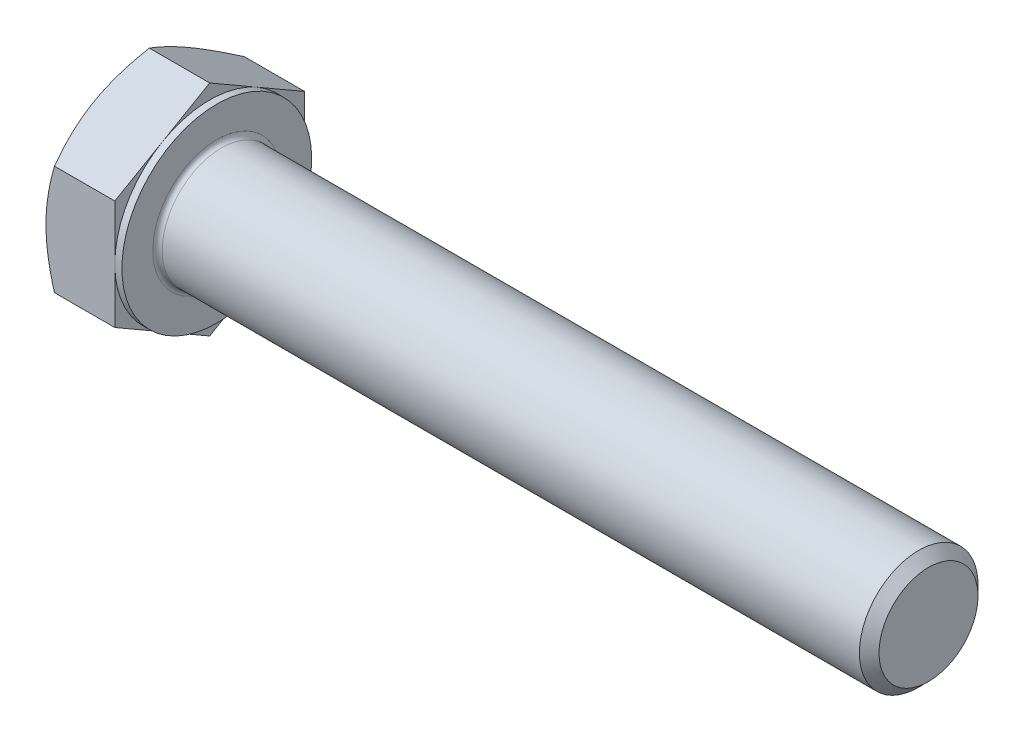
ISO-10303-21;
HEADER;
FILE_DESCRIPTION(('STEP AP214'),'2;1');
FILE_NAME('part.step','',(''),(''),'','','');
FILE_SCHEMA(('AUTOMOTIVE_DESIGN { 1 0 10303 214 1 1 1 1 }'));
ENDSEC;
DATA;
#1=APPLICATION_CONTEXT('core data for automotive mechanical design processes');
#2=APPLICATION_PROTOCOL_DEFINITION('international standard','automotive_design',2000,#1);
#3=PRODUCT_CONTEXT('',#1,'mechanical');
#4=PRODUCT('Part','Part','',(#3));
#5=PRODUCT_RELATED_PRODUCT_CATEGORY('part','',(#4));
#6=PRODUCT_DEFINITION_FORMATION('','',#4);
#7=PRODUCT_DEFINITION_CONTEXT('part definition',#1,'design');
#8=PRODUCT_DEFINITION('design','',#6,#7);
#9=PRODUCT_DEFINITION_SHAPE('','',#8);
#10=(LENGTH_UNIT() NAMED_UNIT(*) SI_UNIT(.MILLI.,.METRE.));
#11=(NAMED_UNIT(*) PLANE_ANGLE_UNIT() SI_UNIT($,.RADIAN.));
#12=(NAMED_UNIT(*) SI_UNIT($,.STERADIAN.) SOLID_ANGLE_UNIT());
#13=UNCERTAINTY_MEASURE_WITH_UNIT(LENGTH_MEASURE(1.E-05),#10,'distance_accuracy_value','');
#14=(GEOMETRIC_REPRESENTATION_CONTEXT(3) GLOBAL_UNCERTAINTY_ASSIGNED_CONTEXT((#13)) GLOBAL_UNIT_ASSIGNED_CONTEXT((#10,
#11,#12)) REPRESENTATION_CONTEXT('',''));
#15=CARTESIAN_POINT('',(0.,0.,0.));
#16=DIRECTION('',(0.,0.,1.));
#17=DIRECTION('',(1.,0.,0.));
#18=AXIS2_PLACEMENT_3D('',#15,#16,#17);
#19=CARTESIAN_POINT('',(6.4,9.23760430703402,0.));
#20=DIRECTION('',(1.,0.,0.));
#21=DIRECTION('',(0.,0.,-1.));
#22=AXIS2_PLACEMENT_3D('',#19,#20,#21);
#23=PLANE('',#22);
#24=CARTESIAN_POINT('',(6.4,0.,0.));
#25=DIRECTION('',(1.,0.,0.));
#26=DIRECTION('',(0.,0.,-1.));
#27=AXIS2_PLACEMENT_3D('',#24,#25,#26);
#28=CIRCLE('',#27,5.4);
#29=CARTESIAN_POINT('',(6.4,0.,-5.4));
#30=VERTEX_POINT('',#29);
#31=EDGE_CURVE('E44',#30,#30,#28,.F.);
#32=ORIENTED_EDGE('',*,*,#31,.T.);
#33=EDGE_LOOP('',(#32));
#34=FACE_BOUND('',#33,.T.);
#35=CARTESIAN_POINT('',(6.4,0.,0.));
#36=DIRECTION('',(1.,0.,0.));
#37=DIRECTION('',(0.,0.,-1.));
#38=AXIS2_PLACEMENT_3D('',#35,#36,#37);
#39=CIRCLE('',#38,8.);
#40=CARTESIAN_POINT('',(6.4,0.,-8.));
#41=VERTEX_POINT('',#40);
#42=EDGE_CURVE('E257',#41,#41,#39,.T.);
#43=ORIENTED_EDGE('',*,*,#42,.T.);
#44=EDGE_LOOP('',(#43));
#45=FACE_BOUND('',#44,.T.);
#46=ADVANCED_FACE('F35',(#34,#45),#23,.T.);
#47=CARTESIAN_POINT('',(0.,0.,0.));
#48=DIRECTION('',(-1.,0.,0.));
#49=DIRECTION('',(0.,0.,1.));
#50=AXIS2_PLACEMENT_3D('',#47,#48,#49);
#51=CYLINDRICAL_SURFACE('',#50,5.);
#52=CARTESIAN_POINT('',(6.8,0.,0.));
#53=DIRECTION('',(1.,0.,0.));
#54=DIRECTION('',(0.,0.,-1.));
#55=AXIS2_PLACEMENT_3D('',#52,#53,#54);
#56=CIRCLE('',#55,5.);
#57=CARTESIAN_POINT('',(6.8,0.,-5.));
#58=VERTEX_POINT('',#57);
#59=EDGE_CURVE('E11',#58,#58,#56,.T.);
#60=ORIENTED_EDGE('',*,*,#59,.T.);
#61=EDGE_LOOP('',(#60));
#62=FACE_BOUND('',#61,.T.);
#63=CARTESIAN_POINT('',(65.572,0.,0.));
#64=DIRECTION('',(-1.,0.,0.));
#65=DIRECTION('',(0.,0.,1.));
#66=AXIS2_PLACEMENT_3D('',#63,#64,#65);
#67=CIRCLE('',#66,5.);
#68=CARTESIAN_POINT('',(65.572,0.,5.));
#69=VERTEX_POINT('',#68);
#70=EDGE_CURVE('E303',#69,#69,#67,.T.);
#71=ORIENTED_EDGE('',*,*,#70,.T.);
#72=EDGE_LOOP('',(#71));
#73=FACE_BOUND('',#72,.T.);
#74=ADVANCED_FACE('F244',(#62,#73),#51,.T.);
#75=CARTESIAN_POINT('',(66.4,0.,0.));
#76=DIRECTION('',(-1.,0.,0.));
#77=DIRECTION('',(0.,0.,1.));
#78=AXIS2_PLACEMENT_3D('',#75,#76,#77);
#79=CONICAL_SURFACE('',#78,4.172,0.785398163397444);
#80=ORIENTED_EDGE('',*,*,#70,.F.);
#81=EDGE_LOOP('',(#80));
#82=FACE_BOUND('',#81,.T.);
#83=CARTESIAN_POINT('',(66.4,0.,0.));
#84=DIRECTION('',(-1.,0.,0.));
#85=DIRECTION('',(0.,0.,1.));
#86=AXIS2_PLACEMENT_3D('',#83,#84,#85);
#87=CIRCLE('',#86,4.172);
#88=CARTESIAN_POINT('',(66.4,0.,4.172));
#89=VERTEX_POINT('',#88);
#90=EDGE_CURVE('E305',#89,#89,#87,.T.);
#91=ORIENTED_EDGE('',*,*,#90,.T.);
#92=EDGE_LOOP('',(#91));
#93=FACE_BOUND('',#92,.T.);
#94=ADVANCED_FACE('F249',(#82,#93),#79,.T.);
#95=CARTESIAN_POINT('',(66.4,0.,0.));
#96=DIRECTION('',(-1.,0.,0.));
#97=DIRECTION('',(0.,0.,1.));
#98=AXIS2_PLACEMENT_3D('',#95,#96,#97);
#99=PLANE('',#98);
#100=ORIENTED_EDGE('',*,*,#90,.F.);
#101=EDGE_LOOP('',(#100));
#102=FACE_BOUND('',#101,.T.);
#103=ADVANCED_FACE('F352',(#102),#99,.F.);
#104=CARTESIAN_POINT('',(5.8,8.,0.));
#105=DIRECTION('',(1.,0.,0.));
#106=DIRECTION('',(0.,0.,-1.));
#107=AXIS2_PLACEMENT_3D('',#104,#105,#106);
#108=PLANE('',#107);
#109=DIRECTION('',(0.,0.500000000000001,0.866025403784438));
#110=VECTOR('',#109,1.);
#111=CARTESIAN_POINT('',(5.8,4.61880215351699,-8.));
#112=LINE('',#111,#110);
#113=CARTESIAN_POINT('',(5.8,4.61880215351699,-8.));
#114=VERTEX_POINT('',#113);
#115=CARTESIAN_POINT('',(5.8,6.9282032302755,-4.00000000000001));
#116=VERTEX_POINT('',#115);
#117=EDGE_CURVE('E168',#114,#116,#112,.T.);
#118=ORIENTED_EDGE('',*,*,#117,.T.);
#119=CARTESIAN_POINT('',(5.8,0.,0.));
#120=DIRECTION('',(-1.,0.,0.));
#121=DIRECTION('',(0.,0.,1.));
#122=AXIS2_PLACEMENT_3D('',#119,#120,#121);
#123=CIRCLE('',#122,8.);
#124=CARTESIAN_POINT('',(5.8,0.,-8.));
#125=VERTEX_POINT('',#124);
#126=EDGE_CURVE('E51',#116,#125,#123,.T.);
#127=ORIENTED_EDGE('',*,*,#126,.T.);
#128=DIRECTION('',(0.,1.,0.));
#129=VECTOR('',#128,1.);
#130=CARTESIAN_POINT('',(5.8,4.61880215351699,-8.));
#131=LINE('',#130,#129);
#132=EDGE_CURVE('E259',#125,#114,#131,.T.);
#133=ORIENTED_EDGE('',*,*,#132,.T.);
#134=EDGE_LOOP('',(#118,#127,#133));
#135=FACE_BOUND('',#134,.T.);
#136=ADVANCED_FACE('F282',(#135),#108,.T.);
#137=CARTESIAN_POINT('',(5.8,9.23760430703402,0.));
#138=VERTEX_POINT('',#137);
#139=EDGE_CURVE('E166',#116,#138,#112,.T.);
#140=ORIENTED_EDGE('',*,*,#139,.T.);
#141=DIRECTION('',(0.,-0.500000000000001,0.866025403784438));
#142=VECTOR('',#141,1.);
#143=CARTESIAN_POINT('',(5.8,9.23760430703402,0.));
#144=LINE('',#143,#142);
#145=CARTESIAN_POINT('',(5.8,6.92820323027551,4.00000000000001));
#146=VERTEX_POINT('',#145);
#147=EDGE_CURVE('E165',#138,#146,#144,.T.);
#148=ORIENTED_EDGE('',*,*,#147,.T.);
#149=EDGE_CURVE('E154',#146,#116,#123,.T.);
#150=ORIENTED_EDGE('',*,*,#149,.T.);
#151=EDGE_LOOP('',(#140,#148,#150));
#152=FACE_BOUND('',#151,.T.);
#153=ADVANCED_FACE('F289',(#152),#108,.T.);
#154=CARTESIAN_POINT('',(5.8,4.618802153517,8.));
#155=VERTEX_POINT('',#154);
#156=EDGE_CURVE('E133',#146,#155,#144,.T.);
#157=ORIENTED_EDGE('',*,*,#156,.T.);
#158=DIRECTION('',(0.,-1.,0.));
#159=VECTOR('',#158,1.);
#160=CARTESIAN_POINT('',(5.8,4.618802153517,8.));
#161=LINE('',#160,#159);
#162=CARTESIAN_POINT('',(5.8,0.,8.));
#163=VERTEX_POINT('',#162);
#164=EDGE_CURVE('E127',#155,#163,#161,.T.);
#165=ORIENTED_EDGE('',*,*,#164,.T.);
#166=EDGE_CURVE('E131',#163,#146,#123,.T.);
#167=ORIENTED_EDGE('',*,*,#166,.T.);
#168=EDGE_LOOP('',(#157,#165,#167));
#169=FACE_BOUND('',#168,.T.);
#170=ADVANCED_FACE('F129',(#169),#108,.T.);
#171=CARTESIAN_POINT('',(5.8,-4.61880215351701,8.));
#172=VERTEX_POINT('',#171);
#173=EDGE_CURVE('E137',#163,#172,#161,.T.);
#174=ORIENTED_EDGE('',*,*,#173,.T.);
#175=DIRECTION('',(0.,-0.500000000000002,-0.866025403784438));
#176=VECTOR('',#175,1.);
#177=CARTESIAN_POINT('',(5.8,-9.23760430703403,0.));
#178=LINE('',#177,#176);
#179=CARTESIAN_POINT('',(5.8,-6.9282032302755,4.00000000000001));
#180=VERTEX_POINT('',#179);
#181=EDGE_CURVE('E144',#172,#180,#178,.T.);
#182=ORIENTED_EDGE('',*,*,#181,.T.);
#183=EDGE_CURVE('E141',#180,#163,#123,.T.);
#184=ORIENTED_EDGE('',*,*,#183,.T.);
#185=EDGE_LOOP('',(#174,#182,#184));
#186=FACE_BOUND('',#185,.T.);
#187=ADVANCED_FACE('F142',(#186),#108,.T.);
#188=CARTESIAN_POINT('',(5.8,-9.23760430703403,0.));
#189=VERTEX_POINT('',#188);
#190=EDGE_CURVE('E160',#180,#189,#178,.T.);
#191=ORIENTED_EDGE('',*,*,#190,.T.);
#192=DIRECTION('',(0.,0.5,-0.866025403784438));
#193=VECTOR('',#192,1.);
#194=CARTESIAN_POINT('',(5.8,-4.61880215351702,-8.));
#195=LINE('',#194,#193);
#196=CARTESIAN_POINT('',(5.8,-6.92820323027551,-4.));
#197=VERTEX_POINT('',#196);
#198=EDGE_CURVE('E343',#189,#197,#195,.T.);
#199=ORIENTED_EDGE('',*,*,#198,.T.);
#200=EDGE_CURVE('E148',#197,#180,#123,.T.);
#201=ORIENTED_EDGE('',*,*,#200,.T.);
#202=EDGE_LOOP('',(#191,#199,#201));
#203=FACE_BOUND('',#202,.T.);
#204=ADVANCED_FACE('F344',(#203),#108,.T.);
#205=CARTESIAN_POINT('',(5.8,-4.61880215351702,-8.));
#206=VERTEX_POINT('',#205);
#207=EDGE_CURVE('E155',#197,#206,#195,.T.);
#208=ORIENTED_EDGE('',*,*,#207,.T.);
#209=EDGE_CURVE('E263',#206,#125,#131,.T.);
#210=ORIENTED_EDGE('',*,*,#209,.T.);
#211=EDGE_CURVE('E275',#125,#197,#123,.T.);
#212=ORIENTED_EDGE('',*,*,#211,.T.);
#213=EDGE_LOOP('',(#208,#210,#212));
#214=FACE_BOUND('',#213,.T.);
#215=ADVANCED_FACE('F274',(#214),#108,.T.);
#216=CARTESIAN_POINT('',(0.,0.,0.));
#217=DIRECTION('',(-1.,0.,0.));
#218=DIRECTION('',(0.,0.,1.));
#219=AXIS2_PLACEMENT_3D('',#216,#217,#218);
#220=CYLINDRICAL_SURFACE('',#219,8.);
#221=ORIENTED_EDGE('',*,*,#126,.F.);
#222=ORIENTED_EDGE('',*,*,#149,.F.);
#223=ORIENTED_EDGE('',*,*,#166,.F.);
#224=ORIENTED_EDGE('',*,*,#183,.F.);
#225=ORIENTED_EDGE('',*,*,#200,.F.);
#226=ORIENTED_EDGE('',*,*,#211,.F.);
#227=EDGE_LOOP('',(#221,#222,#223,#224,#225,#226));
#228=FACE_BOUND('',#227,.T.);
#229=ORIENTED_EDGE('',*,*,#42,.F.);
#230=EDGE_LOOP('',(#229));
#231=FACE_BOUND('',#230,.T.);
#232=ADVANCED_FACE('F151',(#228,#231),#220,.T.);
#233=CARTESIAN_POINT('',(0.,9.23760430703402,0.));
#234=DIRECTION('',(1.,0.,0.));
#235=DIRECTION('',(0.,0.,-1.));
#236=AXIS2_PLACEMENT_3D('',#233,#234,#235);
#237=PLANE('',#236);
#238=CARTESIAN_POINT('',(0.,0.,0.));
#239=DIRECTION('',(1.,0.,0.));
#240=DIRECTION('',(0.,0.,-1.));
#241=AXIS2_PLACEMENT_3D('',#238,#239,#240);
#242=CIRCLE('',#241,8.);
#243=CARTESIAN_POINT('',(0.,0.,-8.));
#244=VERTEX_POINT('',#243);
#245=CARTESIAN_POINT('',(0.,6.9282032302755,-4.00000000000001));
#246=VERTEX_POINT('',#245);
#247=EDGE_CURVE('E260',#244,#246,#242,.T.);
#248=ORIENTED_EDGE('',*,*,#247,.F.);
#249=CARTESIAN_POINT('',(0.,-6.92820323027551,-4.));
#250=VERTEX_POINT('',#249);
#251=EDGE_CURVE('E267',#250,#244,#242,.T.);
#252=ORIENTED_EDGE('',*,*,#251,.F.);
#253=CARTESIAN_POINT('',(0.,-6.9282032302755,4.00000000000001));
#254=VERTEX_POINT('',#253);
#255=EDGE_CURVE('E325',#254,#250,#242,.T.);
#256=ORIENTED_EDGE('',*,*,#255,.F.);
#257=CARTESIAN_POINT('',(0.,0.,8.));
#258=VERTEX_POINT('',#257);
#259=EDGE_CURVE('E321',#258,#254,#242,.T.);
#260=ORIENTED_EDGE('',*,*,#259,.F.);
#261=CARTESIAN_POINT('',(0.,0.,0.));
#262=DIRECTION('',(-1.,0.,0.));
#263=DIRECTION('',(0.,0.,1.));
#264=AXIS2_PLACEMENT_3D('',#261,#262,#263);
#265=CIRCLE('',#264,8.);
#266=CARTESIAN_POINT('',(0.,6.92820323027551,4.00000000000001));
#267=VERTEX_POINT('',#266);
#268=EDGE_CURVE('E169',#258,#267,#265,.T.);
#269=ORIENTED_EDGE('',*,*,#268,.T.);
#270=EDGE_CURVE('E265',#246,#267,#242,.T.);
#271=ORIENTED_EDGE('',*,*,#270,.F.);
#272=EDGE_LOOP('',(#248,#252,#256,#260,#269,#271));
#273=FACE_BOUND('',#272,.T.);
#274=ADVANCED_FACE('F322',(#273),#237,.F.);
#275=CARTESIAN_POINT('',(0.,0.,0.));
#276=DIRECTION('',(1.,0.,0.));
#277=DIRECTION('',(0.,0.,-1.));
#278=AXIS2_PLACEMENT_3D('',#275,#276,#277);
#279=CONICAL_SURFACE('',#278,8.,1.0471975511966);
#280=CARTESIAN_POINT('',(0.714597847732967,4.61868668346316,8.0002));
#281=CARTESIAN_POINT('',(0.655990714047292,4.72021302617289,7.8243512161201));
#282=CARTESIAN_POINT('',(0.600043401047285,4.82211789504564,7.64784680569387));
#283=CARTESIAN_POINT('',(0.494201005024662,5.02675523421805,7.29340453712154));
#284=CARTESIAN_POINT('',(0.444308534431063,5.12948804149869,7.11546609530729));
#285=CARTESIAN_POINT('',(0.304692797206863,5.43933133858026,6.57880176237736));
#286=CARTESIAN_POINT('',(0.225281170978366,5.64766491807817,6.21795741776428));
#287=CARTESIAN_POINT('',(0.132161646294487,5.95943209350317,5.67796082979595));
#288=CARTESIAN_POINT('',(0.105634581029123,6.06193429416807,5.50042181035672));
#289=CARTESIAN_POINT('',(0.0611531748588755,6.26740224104454,5.14454088703981));
#290=CARTESIAN_POINT('',(0.0431980765145798,6.37036794548792,4.96619905550676));
#291=CARTESIAN_POINT('',(0.0163156484918646,6.57647664551585,4.60920831517641));
#292=CARTESIAN_POINT('',(0.0073780735462325,6.67961930623067,4.4305599863905));
#293=CARTESIAN_POINT('',(-0.00127769603487081,6.88599991003618,4.07309829490262));
#294=CARTESIAN_POINT('',(-0.000996175497150669,6.98923785008464,3.89428493746994));
#295=CARTESIAN_POINT('',(0.00814502526877508,7.18224506616975,3.5599866329831));
#296=CARTESIAN_POINT('',(0.015889604367369,7.27202796205376,3.40447809566133));
#297=CARTESIAN_POINT('',(0.0382011348534271,7.45138347289924,3.09382523825949));
#298=CARTESIAN_POINT('',(0.0527685461381461,7.5409560732765,2.93868094344001));
#299=CARTESIAN_POINT('',(0.106360690527534,7.80932710333148,2.47384868410519));
#300=CARTESIAN_POINT('',(0.155268641669142,7.98765049311728,2.16498351281829));
#301=CARTESIAN_POINT('',(0.27753940323431,8.34618890253624,1.54397677123971));
#302=CARTESIAN_POINT('',(0.351420520375996,8.52635816315521,1.23191445788553));
#303=CARTESIAN_POINT('',(0.519100141254967,8.88400987687704,0.612443518305243));
#304=CARTESIAN_POINT('',(0.61285926085445,9.06149691008278,0.30502695910825));
#305=CARTESIAN_POINT('',(0.71459784773297,9.23771977708785,-0.000199999999999668));
#306=B_SPLINE_CURVE_WITH_KNOTS('',3,(#280,#281,#282,#283,#284,#285,#286,#287,#288,#289,#290,
#291,#292,#293,#294,#295,#296,#297,#298,#299,#300,#301,#302,#303,#304,#305),.UNSPECIFIED.,.F.,
.F.,(4,2,2,2,2,2,2,2,2,2,2,2,4),(0.,0.63397354372135,1.26821965714356,2.53934712434765,
3.15934343977049,3.77928496069783,4.39852133866765,5.01773858515595,5.55680239410248,
6.09590254421147,7.17487077411835,8.27776850154293,9.37850115249055),.UNSPECIFIED.);
#307=CARTESIAN_POINT('',(0.71453117981632,9.23760430703402,0.));
#308=VERTEX_POINT('',#307);
#309=EDGE_CURVE('E215',#267,#308,#306,.T.);
#310=ORIENTED_EDGE('',*,*,#309,.T.);
#311=CARTESIAN_POINT('',(0.71459784773297,9.23771977708785,0.0002));
#312=CARTESIAN_POINT('',(0.655990714047296,9.13619343437813,-0.175648783879896));
#313=CARTESIAN_POINT('',(0.600043401047289,9.03428856550538,-0.352153194306135));
#314=CARTESIAN_POINT('',(0.494201005024665,8.82965122633297,-0.70659546287846));
#315=CARTESIAN_POINT('',(0.444308534431065,8.72691841905233,-0.884533904692711));
#316=CARTESIAN_POINT('',(0.304692797206864,8.41707512197076,-1.42119823762264));
#317=CARTESIAN_POINT('',(0.225281170978367,8.20874154247284,-1.78204258223572));
#318=CARTESIAN_POINT('',(0.132161646294488,7.89697436704785,-2.32203917020405));
#319=CARTESIAN_POINT('',(0.105634581029123,7.79447216638294,-2.49957818964328));
#320=CARTESIAN_POINT('',(0.0611531748588745,7.58900421950647,-2.8554591129602));
#321=CARTESIAN_POINT('',(0.0431980765145785,7.4860385150631,-3.03380094449324));
#322=CARTESIAN_POINT('',(0.0163156484918633,7.27992981503517,-3.39079168482359));
#323=CARTESIAN_POINT('',(0.00737807354623154,7.17678715432034,-3.5694400136095));
#324=CARTESIAN_POINT('',(-0.00127769603487235,6.97040655051484,-3.92690170509738));
#325=CARTESIAN_POINT('',(-0.000996175497153107,6.86716861046638,-4.10571506253006));
#326=CARTESIAN_POINT('',(0.00814502526877204,6.67416139438126,-4.4400133670169));
#327=CARTESIAN_POINT('',(0.0158896043673661,6.58437849849726,-4.59552190433867));
#328=CARTESIAN_POINT('',(0.0382011348534242,6.40502298765178,-4.90617476174051));
#329=CARTESIAN_POINT('',(0.052768546138143,6.31545038727451,-5.06131905655999));
#330=CARTESIAN_POINT('',(0.106360690527531,6.04707935721953,-5.52615131589481));
#331=CARTESIAN_POINT('',(0.155268641669138,5.86875596743374,-5.83501648718171));
#332=CARTESIAN_POINT('',(0.277539403234306,5.51021755801477,-6.4560232287603));
#333=CARTESIAN_POINT('',(0.351420520375991,5.3300482973958,-6.76808554211447));
#334=CARTESIAN_POINT('',(0.519100141254961,4.97239658367397,-7.38755648169476));
#335=CARTESIAN_POINT('',(0.612859260854444,4.79490955046824,-7.69497304089175));
#336=CARTESIAN_POINT('',(0.714597847732965,4.61868668346316,-8.0002));
#337=B_SPLINE_CURVE_WITH_KNOTS('',3,(#311,#312,#313,#314,#315,#316,#317,#318,#319,#320,#321,
#322,#323,#324,#325,#326,#327,#328,#329,#330,#331,#332,#333,#334,#335,#336),.UNSPECIFIED.,.F.,
.F.,(4,2,2,2,2,2,2,2,2,2,2,2,4),(0.,0.63397354372135,1.26821965714356,2.53934712434766,
3.15934343977049,3.77928496069784,4.39852133866766,5.01773858515595,5.55680239410249,
6.09590254421148,7.17487077411835,8.27776850154293,9.37850115249055),.UNSPECIFIED.);
#338=EDGE_CURVE('E59',#308,#246,#337,.T.);
#339=ORIENTED_EDGE('',*,*,#338,.T.);
#340=ORIENTED_EDGE('',*,*,#270,.T.);
#341=EDGE_LOOP('',(#310,#339,#340));
#342=FACE_BOUND('',#341,.T.);
#343=ADVANCED_FACE('F319',(#342),#279,.T.);
#344=CARTESIAN_POINT('',(4.02490590955888,-12.6546855843617,7.99999999999999));
#345=CARTESIAN_POINT('',(3.8533848737599,-12.3031246800229,7.99999999999999));
#346=CARTESIAN_POINT('',(3.68343819387199,-11.9507829192251,7.99999999999999));
#347=CARTESIAN_POINT('',(3.34757427772114,-11.2441233293434,7.99999999999999));
#348=CARTESIAN_POINT('',(3.18165763115449,-10.889805220286,7.99999999999999));
#349=CARTESIAN_POINT('',(2.85395194343766,-10.1770689379398,7.99999999999999));
#350=CARTESIAN_POINT('',(2.6921882496399,-9.8186390717221,7.99999999999999));
#351=CARTESIAN_POINT('',(2.37495726740338,-9.09901412811099,7.99999999999999));
#352=CARTESIAN_POINT('',(2.21948969724233,-8.73781917530422,7.99999999999999));
#353=CARTESIAN_POINT('',(1.91124909611306,-7.99950051377995,7.99999999999999));
#354=CARTESIAN_POINT('',(1.75875676572666,-7.62225899058111,7.99999999999999));
#355=CARTESIAN_POINT('',(1.46472411298909,-6.86345576673942,7.99999999999999));
#356=CARTESIAN_POINT('',(1.32318498461756,-6.48189360029688,8.));
#357=CARTESIAN_POINT('',(1.05459432501407,-5.71447512364444,8.));
#358=CARTESIAN_POINT('',(0.927515476081558,-5.32862847439955,8.));
#359=CARTESIAN_POINT('',(0.691757211097742,-4.55141880373957,8.));
#360=CARTESIAN_POINT('',(0.583072254842115,-4.16005748194273,8.));
#361=CARTESIAN_POINT('',(0.38975037684422,-3.3737637827452,8.));
#362=CARTESIAN_POINT('',(0.304973724086276,-2.97886668674349,7.99999999999999));
#363=CARTESIAN_POINT('',(0.19927520023723,-2.38273452840882,8.));
#364=CARTESIAN_POINT('',(0.167618755709461,-2.1833797771194,8.));
#365=CARTESIAN_POINT('',(0.112075358694774,-1.78359737601686,8.));
#366=CARTESIAN_POINT('',(0.0881876500546175,-1.58316983255305,8.));
#367=CARTESIAN_POINT('',(0.0489706977401169,-1.18423542027826,8.));
#368=CARTESIAN_POINT('',(0.0335291730980847,-0.98573963745877,8.));
#369=CARTESIAN_POINT('',(0.0110629716488631,-0.588272086946685,8.));
#370=CARTESIAN_POINT('',(0.00403814825766994,-0.389300327604096,8.));
#371=CARTESIAN_POINT('',(-0.00142584062082165,0.00876221081483254,8.));
#372=CARTESIAN_POINT('',(0.00013495767647439,0.20785298938559,8.));
#373=CARTESIAN_POINT('',(0.0118014217876181,0.605786203078672,8.));
#374=CARTESIAN_POINT('',(0.0219074673810696,0.804628626769908,8.));
#375=CARTESIAN_POINT('',(0.0557165373437138,1.27520491378392,8.));
#376=CARTESIAN_POINT('',(0.083067269524206,1.54668291471763,8.));
#377=CARTESIAN_POINT('',(0.152259238389069,2.08777092307492,8.));
#378=CARTESIAN_POINT('',(0.194102243863654,2.35738069838156,8.));
#379=CARTESIAN_POINT('',(0.339163188799739,3.16301774665639,8.));
#380=CARTESIAN_POINT('',(0.461891294668971,3.69558688173418,8.));
#381=CARTESIAN_POINT('',(0.676586595213055,4.49226053267632,8.));
#382=CARTESIAN_POINT('',(0.754301850106125,4.76044512009595,8.));
#383=CARTESIAN_POINT('',(0.918275616254531,5.29421544036088,8.));
#384=CARTESIAN_POINT('',(1.00453419017724,5.55980115412708,8.));
#385=CARTESIAN_POINT('',(1.18417203245489,6.08844836893932,8.));
#386=CARTESIAN_POINT('',(1.27754931556251,6.35151055086868,8.));
#387=CARTESIAN_POINT('',(1.47027924561322,6.87542420819584,8.));
#388=CARTESIAN_POINT('',(1.56963178297476,7.13627572403553,8.));
#389=CARTESIAN_POINT('',(1.83061788216801,7.80218874880577,8.));
#390=CARTESIAN_POINT('',(1.99585030591403,8.20583800152905,8.));
#391=CARTESIAN_POINT('',(2.33560643435573,9.00922090340249,8.));
#392=CARTESIAN_POINT('',(2.5101309931742,9.40895418858895,8.));
#393=CARTESIAN_POINT('',(2.86641484762337,10.2053302393419,8.));
#394=CARTESIAN_POINT('',(3.04817649203488,10.6019719507727,8.));
#395=CARTESIAN_POINT('',(3.41731474780412,11.3926098653434,8.));
#396=CARTESIAN_POINT('',(3.60469117417195,11.7866061551194,8.));
#397=CARTESIAN_POINT('',(3.98417976786819,12.5730081264134,8.));
#398=CARTESIAN_POINT('',(4.17629837893023,12.9654106921397,8.));
#399=CARTESIAN_POINT('',(4.56413460673705,13.7484335593548,8.));
#400=CARTESIAN_POINT('',(4.75985224746017,14.1390538489476,8.));
#401=CARTESIAN_POINT('',(5.15417790496084,14.91873869301,8.));
#402=CARTESIAN_POINT('',(5.35278537052947,15.3078035265797,8.));
#403=CARTESIAN_POINT('',(5.75241277357112,16.0846929446673,8.));
#404=CARTESIAN_POINT('',(5.95343272118929,16.4725175239607,8.00000000000001));
#405=CARTESIAN_POINT('',(6.52023157707929,17.5591699504467,8.00000000000001));
#406=CARTESIAN_POINT('',(6.88826669162656,18.2568207923885,8.00000000000001));
#407=CARTESIAN_POINT('',(7.62911645716783,19.6496204420456,8.00000000000001));
#408=CARTESIAN_POINT('',(8.00193135552972,20.3447691178627,8.00000000000001));
#409=CARTESIAN_POINT('',(8.74998840178777,21.730949342628,8.00000000000001));
#410=CARTESIAN_POINT('',(9.12521929790285,22.4219869677796,8.00000000000001));
#411=CARTESIAN_POINT('',(9.69012625678299,23.4573861735835,8.00000000000001));
#412=CARTESIAN_POINT('',(9.87876537279042,23.8023143161837,8.00000000000001));
#413=CARTESIAN_POINT('',(10.2566598278907,24.4918321964472,8.00000000000001));
#414=CARTESIAN_POINT('',(10.4459151660087,24.8364219346447,8.00000000000001));
#415=CARTESIAN_POINT('',(10.635441440782,25.1808626322183,8.00000000000001));
#416=B_SPLINE_CURVE_WITH_KNOTS('',3,(#344,#345,#346,#347,#348,#349,#350,#351,#352,#353,#354,
#355,#356,#357,#358,#359,#360,#361,#362,#363,#364,#365,#366,#367,#368,#369,#370,#371,#372,#373,
#374,#375,#376,#377,#378,#379,#380,#381,#382,#383,#384,#385,#386,#387,#388,#389,#390,#391,#392,
#393,#394,#395,#396,#397,#398,#399,#400,#401,#402,#403,#404,#405,#406,#407,#408,#409,#410,#411,
#412,#413,#414,#415),.UNSPECIFIED.,.F.,.F.,(4,2,2,2,2,2,2,2,2,2,2,2,2,2,2,2,2,2,2,2,2,2,2,2,2,2,
2,2,2,2,2,2,2,2,2,4),(0.,1.17352534285519,2.34722138025917,3.52689945010167,4.70652467637677,
5.92708317141315,7.14777452944079,8.36612012171132,9.58409809506408,10.7948027119676,
11.4002329189197,12.0056041799731,12.6027191107726,13.199823642157,13.7969256548693,
14.3940542062034,15.2121538291978,16.0303533369241,17.6675489652002,18.5051258655031,
19.3427089100958,20.1800592201862,21.0173941785985,22.3257038346386,23.6341339573728,
24.9429922461244,26.2518074593073,27.5625113626671,28.8732240016859,30.1836898283921,
31.4941611678941,33.8604585893124,36.2268789719357,38.5858914350282,39.7653150976312,
40.9447368953005),.UNSPECIFIED.);
#417=CARTESIAN_POINT('',(0.714531179816316,4.618802153517,8.));
#418=VERTEX_POINT('',#417);
#419=EDGE_CURVE('E227',#258,#418,#416,.T.);
#420=ORIENTED_EDGE('',*,*,#419,.T.);
#421=EDGE_CURVE('E226',#418,#267,#306,.T.);
#422=ORIENTED_EDGE('',*,*,#421,.T.);
#423=ORIENTED_EDGE('',*,*,#268,.F.);
#424=EDGE_LOOP('',(#420,#422,#423));
#425=FACE_BOUND('',#424,.T.);
#426=ADVANCED_FACE('F316',(#425),#279,.T.);
#427=CARTESIAN_POINT('',(0.714531179816316,-4.61880215351701,8.));
#428=VERTEX_POINT('',#427);
#429=EDGE_CURVE('E307',#428,#258,#416,.T.);
#430=ORIENTED_EDGE('',*,*,#429,.T.);
#431=ORIENTED_EDGE('',*,*,#259,.T.);
#432=CARTESIAN_POINT('',(0.714597847732981,-9.23771977708787,-0.000199999999999317));
#433=CARTESIAN_POINT('',(0.655990714047306,-9.13619343437814,0.175648783879897));
#434=CARTESIAN_POINT('',(0.600043401047299,-9.0342885655054,0.352153194306136));
#435=CARTESIAN_POINT('',(0.494201005024674,-8.82965122633298,0.70659546287846));
#436=CARTESIAN_POINT('',(0.444308534431074,-8.72691841905234,0.884533904692713));
#437=CARTESIAN_POINT('',(0.304692797206873,-8.41707512197077,1.42119823762264));
#438=CARTESIAN_POINT('',(0.225281170978376,-8.20874154247286,1.78204258223573));
#439=CARTESIAN_POINT('',(0.132161646294496,-7.89697436704786,2.32203917020405));
#440=CARTESIAN_POINT('',(0.105634581029131,-7.79447216638296,2.49957818964329));
#441=CARTESIAN_POINT('',(0.0611531748588822,-7.58900421950648,2.8554591129602));
#442=CARTESIAN_POINT('',(0.0431980765145868,-7.48603851506311,3.03380094449324));
#443=CARTESIAN_POINT('',(0.0163156484918718,-7.27992981503518,3.3907916848236));
#444=CARTESIAN_POINT('',(0.00737807354623957,-7.17678715432036,3.5694400136095));
#445=CARTESIAN_POINT('',(-0.00127769603486461,-6.97040655051485,3.92690170509739));
#446=CARTESIAN_POINT('',(-0.000996175497145178,-6.86716861046639,4.10571506253007));
#447=CARTESIAN_POINT('',(0.00814502526878012,-6.67416139438127,4.44001336701691));
#448=CARTESIAN_POINT('',(0.0158896043673741,-6.58437849849727,4.59552190433867));
#449=CARTESIAN_POINT('',(0.0382011348534318,-6.40502298765179,4.90617476174051));
#450=CARTESIAN_POINT('',(0.05276854613815,-6.31545038727452,5.06131905656));
#451=CARTESIAN_POINT('',(0.106360690527537,-6.04707935721954,5.52615131589482));
#452=CARTESIAN_POINT('',(0.155268641669145,-5.86875596743375,5.83501648718172));
#453=CARTESIAN_POINT('',(0.277539403234312,-5.51021755801478,6.4560232287603));
#454=CARTESIAN_POINT('',(0.351420520375996,-5.33004829739581,6.76808554211448));
#455=CARTESIAN_POINT('',(0.519100141254965,-4.97239658367398,7.38755648169476));
#456=CARTESIAN_POINT('',(0.612859260854447,-4.79490955046825,7.69497304089175));
#457=CARTESIAN_POINT('',(0.714597847732967,-4.61868668346317,8.0002));
#458=B_SPLINE_CURVE_WITH_KNOTS('',3,(#432,#433,#434,#435,#436,#437,#438,#439,#440,#441,#442,
#443,#444,#445,#446,#447,#448,#449,#450,#451,#452,#453,#454,#455,#456,#457),.UNSPECIFIED.,.F.,
.F.,(4,2,2,2,2,2,2,2,2,2,2,2,4),(0.,0.633973543721351,1.26821965714356,2.53934712434766,
3.15934343977049,3.77928496069784,4.39852133866766,5.01773858515596,5.55680239410249,
6.09590254421148,7.17487077411835,8.27776850154293,9.37850115249055),.UNSPECIFIED.);
#459=EDGE_CURVE('E217',#254,#428,#458,.T.);
#460=ORIENTED_EDGE('',*,*,#459,.T.);
#461=EDGE_LOOP('',(#430,#431,#460));
#462=FACE_BOUND('',#461,.T.);
#463=ADVANCED_FACE('F187',(#462),#279,.T.);
#464=CARTESIAN_POINT('',(0.714531179816329,-9.23760430703403,0.));
#465=VERTEX_POINT('',#464);
#466=EDGE_CURVE('E210',#465,#254,#458,.T.);
#467=ORIENTED_EDGE('',*,*,#466,.T.);
#468=ORIENTED_EDGE('',*,*,#255,.T.);
#469=CARTESIAN_POINT('',(0.714597847732974,-4.61868668346318,-8.0002));
#470=CARTESIAN_POINT('',(0.655990714047299,-4.72021302617291,-7.82435121612011));
#471=CARTESIAN_POINT('',(0.600043401047292,-4.82211789504566,-7.64784680569387));
#472=CARTESIAN_POINT('',(0.494201005024669,-5.02675523421807,-7.29340453712154));
#473=CARTESIAN_POINT('',(0.44430853443107,-5.12948804149871,-7.11546609530729));
#474=CARTESIAN_POINT('',(0.304692797206871,-5.43933133858028,-6.57880176237736));
#475=CARTESIAN_POINT('',(0.225281170978374,-5.64766491807819,-6.21795741776428));
#476=CARTESIAN_POINT('',(0.132161646294495,-5.95943209350319,-5.67796082979595));
#477=CARTESIAN_POINT('',(0.105634581029131,-6.06193429416809,-5.50042181035672));
#478=CARTESIAN_POINT('',(0.0611531748588832,-6.26740224104457,-5.1445408870398));
#479=CARTESIAN_POINT('',(0.0431980765145875,-6.37036794548794,-4.96619905550676));
#480=CARTESIAN_POINT('',(0.0163156484918731,-6.57647664551587,-4.60920831517641));
#481=CARTESIAN_POINT('',(0.00737807354624189,-6.67961930623069,-4.4305599863905));
#482=CARTESIAN_POINT('',(-0.00127769603486067,-6.8859999100362,-4.07309829490262));
#483=CARTESIAN_POINT('',(-0.000996175497140609,-6.98923785008466,-3.89428493746993));
#484=CARTESIAN_POINT('',(0.00814502526878505,-7.18224506616977,-3.5599866329831));
#485=CARTESIAN_POINT('',(0.0158896043673789,-7.27202796205378,-3.40447809566133));
#486=CARTESIAN_POINT('',(0.0382011348534374,-7.45138347289926,-3.09382523825949));
#487=CARTESIAN_POINT('',(0.0527685461381567,-7.54095607327652,-2.93868094344));
#488=CARTESIAN_POINT('',(0.106360690527545,-7.8093271033315,-2.47384868410518));
#489=CARTESIAN_POINT('',(0.155268641669152,-7.9876504931173,-2.16498351281828));
#490=CARTESIAN_POINT('',(0.277539403234321,-8.34618890253626,-1.5439767712397));
#491=CARTESIAN_POINT('',(0.351420520376006,-8.52635816315523,-1.23191445788552));
#492=CARTESIAN_POINT('',(0.519100141254978,-8.88400987687706,-0.612443518305241));
#493=CARTESIAN_POINT('',(0.612859260854461,-9.06149691008279,-0.305026959108249));
#494=CARTESIAN_POINT('',(0.71459784773298,-9.23771977708787,0.000200000000000716));
#495=B_SPLINE_CURVE_WITH_KNOTS('',3,(#469,#470,#471,#472,#473,#474,#475,#476,#477,#478,#479,
#480,#481,#482,#483,#484,#485,#486,#487,#488,#489,#490,#491,#492,#493,#494),.UNSPECIFIED.,.F.,
.F.,(4,2,2,2,2,2,2,2,2,2,2,2,4),(0.,0.633973543721351,1.26821965714356,2.53934712434766,
3.15934343977049,3.77928496069784,4.39852133866766,5.01773858515595,5.55680239410249,
6.09590254421148,7.17487077411835,8.27776850154293,9.37850115249055),.UNSPECIFIED.);
#496=EDGE_CURVE('E216',#250,#465,#495,.T.);
#497=ORIENTED_EDGE('',*,*,#496,.T.);
#498=EDGE_LOOP('',(#467,#468,#497));
#499=FACE_BOUND('',#498,.T.);
#500=ADVANCED_FACE('F339',(#499),#279,.T.);
#501=CARTESIAN_POINT('',(0.714531179816313,4.61880215351699,-8.));
#502=VERTEX_POINT('',#501);
#503=EDGE_CURVE('E218',#246,#502,#337,.T.);
#504=ORIENTED_EDGE('',*,*,#503,.T.);
#505=CARTESIAN_POINT('',(4.02490591677327,-12.654685599145,-8.));
#506=CARTESIAN_POINT('',(3.8533848806743,-12.3031246943085,-8.));
#507=CARTESIAN_POINT('',(3.68343820048657,-11.9507829330126,-8.));
#508=CARTESIAN_POINT('',(3.34757428373752,-11.2441233421334,-8.));
#509=CARTESIAN_POINT('',(3.18165763687249,-10.8898052325765,-8.));
#510=CARTESIAN_POINT('',(2.85395194855878,-10.177068949224,-8.));
#511=CARTESIAN_POINT('',(2.69218825446257,-9.81863908249932,-8.));
#512=CARTESIAN_POINT('',(2.37495727163403,-9.09901413787102,-8.));
#513=CARTESIAN_POINT('',(2.21948970117939,-8.73781918455397,-8.));
#514=CARTESIAN_POINT('',(1.91124909945299,-7.99950052196693,-8.));
#515=CARTESIAN_POINT('',(1.75875676876377,-7.62225899821523,-8.));
#516=CARTESIAN_POINT('',(1.46472411543646,-6.86345577325908,-8.));
#517=CARTESIAN_POINT('',(1.32318498677801,-6.48189360625494,-8.));
#518=CARTESIAN_POINT('',(1.0545943266276,-5.71447512846895,-8.));
#519=CARTESIAN_POINT('',(0.92751547743501,-5.32862847865214,-8.));
#520=CARTESIAN_POINT('',(0.691757211972647,-4.55141880683299,-8.));
#521=CARTESIAN_POINT('',(0.583072255498522,-4.1600574844489,-8.));
#522=CARTESIAN_POINT('',(0.389750377059009,-3.37376378378106,-8.));
#523=CARTESIAN_POINT('',(0.30497372409415,-2.97886668689223,-8.));
#524=CARTESIAN_POINT('',(0.19927520003407,-2.38273452721078,-8.));
#525=CARTESIAN_POINT('',(0.167618755452533,-2.1833797754699,-8.));
#526=CARTESIAN_POINT('',(0.112075358367339,-1.78359737346044,-8.));
#527=CARTESIAN_POINT('',(0.0881876497104365,-1.58316982954116,-8.));
#528=CARTESIAN_POINT('',(0.0489706974028754,-1.18423541636503,-8.));
#529=CARTESIAN_POINT('',(0.0335291727837703,-0.985739633099708,-8.));
#530=CARTESIAN_POINT('',(0.0110629714200289,-0.588272081696592,-8.));
#531=CARTESIAN_POINT('',(0.00403814809138827,-0.389300321908802,-8.));
#532=CARTESIAN_POINT('',(-0.0014258406230809,0.00876221739737291,-8.));
#533=CARTESIAN_POINT('',(0.00013495777569058,0.207852996410176,-8.));
#534=CARTESIAN_POINT('',(0.011801422126109,0.605786210981713,-8.));
#535=CARTESIAN_POINT('',(0.0219074678573634,0.804628635109359,-8.));
#536=CARTESIAN_POINT('',(0.055716538158749,1.27520492278815,-8.));
#537=CARTESIAN_POINT('',(0.083067270533562,1.54668292394838,-8.));
#538=CARTESIAN_POINT('',(0.152259239797329,2.08777093274817,-8.));
#539=CARTESIAN_POINT('',(0.194102245476499,2.35738070827079,-8.));
#540=CARTESIAN_POINT('',(0.339163191030428,3.16301775718138,-8.));
#541=CARTESIAN_POINT('',(0.461891297316743,3.69558689266571,-8.));
#542=CARTESIAN_POINT('',(0.676586598475547,4.4922605442156,-8.));
#543=CARTESIAN_POINT('',(0.75430185357481,4.7604451318422,-8.));
#544=CARTESIAN_POINT('',(0.918275620129026,5.29421545251861,-8.));
#545=CARTESIAN_POINT('',(1.00453419425135,5.55980116648932,-8.));
#546=CARTESIAN_POINT('',(1.1841720369208,6.08844838170899,-8.));
#547=CARTESIAN_POINT('',(1.27754932022059,6.35151056384126,-8.));
#548=CARTESIAN_POINT('',(1.47027925064867,6.87542422157427,-8.));
#549=CARTESIAN_POINT('',(1.56963178819541,7.13627573761688,-8.));
#550=CARTESIAN_POINT('',(1.83061788769923,7.80218876251031,-8.));
#551=CARTESIAN_POINT('',(1.99585031155407,8.2058380151589,-8.));
#552=CARTESIAN_POINT('',(2.33560644018457,9.00922091689224,-8.));
#553=CARTESIAN_POINT('',(2.51013099908301,9.40895420201328,-8.));
#554=CARTESIAN_POINT('',(2.86641485367069,10.2053302526422,-8.));
#555=CARTESIAN_POINT('',(3.0481764981407,10.6019719640146,-8.));
#556=CARTESIAN_POINT('',(3.41731475401142,11.3926098784746,-8.));
#557=CARTESIAN_POINT('',(3.60469118042221,11.7866061681984,-8.));
#558=CARTESIAN_POINT('',(3.98417977419135,12.5730081393898,-8.));
#559=CARTESIAN_POINT('',(4.17629838528327,12.9654107050659,-8.));
#560=CARTESIAN_POINT('',(4.56413461314096,13.7484335721844,-8.));
#561=CARTESIAN_POINT('',(4.75985225388507,14.1390538617309,-8.));
#562=CARTESIAN_POINT('',(5.15417791142115,14.9187387057042,-8.));
#563=CARTESIAN_POINT('',(5.35278537700419,15.3078035392312,-8.));
#564=CARTESIAN_POINT('',(5.75241278006939,16.0846929572359,-8.));
#565=CARTESIAN_POINT('',(5.95343272769668,16.4725175364891,-8.));
#566=CARTESIAN_POINT('',(6.52023158363776,17.559169962925,-8.));
#567=CARTESIAN_POINT('',(6.88826669822287,18.2568208048589,-8.));
#568=CARTESIAN_POINT('',(7.62911646383152,19.6496204545043,-8.));
#569=CARTESIAN_POINT('',(8.00193136222293,20.3447691303174,-8.));
#570=CARTESIAN_POINT('',(8.74998840854042,21.7309493550892,-8.));
#571=CARTESIAN_POINT('',(9.12521930468549,22.4219869802513,-8.));
#572=CARTESIAN_POINT('',(9.69012626360773,23.4573861860725,-8.));
#573=CARTESIAN_POINT('',(9.87876537962874,23.8023143286788,-8.));
#574=CARTESIAN_POINT('',(10.2566598347553,24.491832208955,-8.));
#575=CARTESIAN_POINT('',(10.4459151728861,24.8364219471591,-8.));
#576=CARTESIAN_POINT('',(10.6354414476717,25.1808626447394,-8.));
#577=B_SPLINE_CURVE_WITH_KNOTS('',3,(#505,#506,#507,#508,#509,#510,#511,#512,#513,#514,#515,
#516,#517,#518,#519,#520,#521,#522,#523,#524,#525,#526,#527,#528,#529,#530,#531,#532,#533,#534,
#535,#536,#537,#538,#539,#540,#541,#542,#543,#544,#545,#546,#547,#548,#549,#550,#551,#552,#553,
#554,#555,#556,#557,#558,#559,#560,#561,#562,#563,#564,#565,#566,#567,#568,#569,#570,#571,#572,
#573,#574,#575,#576),.UNSPECIFIED.,.F.,.F.,(4,2,2,2,2,2,2,2,2,2,2,2,2,2,2,2,2,2,2,2,2,2,2,2,2,2,
2,2,2,2,2,2,2,2,2,4),(0.,1.17352534459167,2.34722138373236,3.52689945532928,4.70652468335868,
5.92708318027306,7.14777454017932,8.36612013432257,9.5840981095466,10.7948027291759,
11.40023293749,12.0056041999049,12.6027191320313,13.1998236647426,13.7969256787822,
14.3940542314437,15.2121538551722,16.0303533636327,17.6675489933806,18.5051258944524,
19.3427089398139,20.180059250671,21.0173942098502,22.3257038658076,23.6341339884585,
24.9429922771239,26.2518074902209,27.5625113934848,28.8732240324076,30.1836898590194,
31.4941611984269,33.8604586198774,36.2268790025322,38.5858914656951,39.7653151283338,
40.9447369260388),.UNSPECIFIED.);
#578=EDGE_CURVE('E180',#502,#244,#577,.F.);
#579=ORIENTED_EDGE('',*,*,#578,.T.);
#580=ORIENTED_EDGE('',*,*,#247,.T.);
#581=EDGE_LOOP('',(#504,#579,#580));
#582=FACE_BOUND('',#581,.T.);
#583=ADVANCED_FACE('F336',(#582),#279,.T.);
#584=CARTESIAN_POINT('',(0.714531179816158,-4.61880215351727,-8.));
#585=VERTEX_POINT('',#584);
#586=EDGE_CURVE('E181',#585,#250,#495,.T.);
#587=ORIENTED_EDGE('',*,*,#586,.T.);
#588=ORIENTED_EDGE('',*,*,#251,.T.);
#589=EDGE_CURVE('E172',#244,#585,#577,.F.);
#590=ORIENTED_EDGE('',*,*,#589,.T.);
#591=EDGE_LOOP('',(#587,#588,#590));
#592=FACE_BOUND('',#591,.T.);
#593=ADVANCED_FACE('F196',(#592),#279,.T.);
#594=CARTESIAN_POINT('',(6.4,4.61880215351699,-8.));
#595=DIRECTION('',(0.,0.,1.));
#596=DIRECTION('',(0.,-1.,0.));
#597=AXIS2_PLACEMENT_3D('',#594,#595,#596);
#598=PLANE('',#597);
#599=ORIENTED_EDGE('',*,*,#209,.F.);
#600=DIRECTION('',(-1.,0.,0.));
#601=VECTOR('',#600,1.);
#602=CARTESIAN_POINT('',(6.4,-4.61880215351702,-8.));
#603=LINE('',#602,#601);
#604=EDGE_CURVE('E300',#206,#585,#603,.T.);
#605=ORIENTED_EDGE('',*,*,#604,.T.);
#606=ORIENTED_EDGE('',*,*,#589,.F.);
#607=ORIENTED_EDGE('',*,*,#578,.F.);
#608=DIRECTION('',(-1.,0.,0.));
#609=VECTOR('',#608,1.);
#610=CARTESIAN_POINT('',(6.4,4.61880215351699,-8.));
#611=LINE('',#610,#609);
#612=EDGE_CURVE('E280',#114,#502,#611,.T.);
#613=ORIENTED_EDGE('',*,*,#612,.F.);
#614=ORIENTED_EDGE('',*,*,#132,.F.);
#615=EDGE_LOOP('',(#599,#605,#606,#607,#613,#614));
#616=FACE_BOUND('',#615,.T.);
#617=ADVANCED_FACE('F191',(#616),#598,.F.);
#618=CARTESIAN_POINT('',(6.4,-4.61880215351702,-8.));
#619=DIRECTION('',(0.,0.866025403784438,0.5));
#620=DIRECTION('',(0.,-0.5,0.866025403784438));
#621=AXIS2_PLACEMENT_3D('',#618,#619,#620);
#622=PLANE('',#621);
#623=ORIENTED_EDGE('',*,*,#198,.F.);
#624=DIRECTION('',(-1.,0.,0.));
#625=VECTOR('',#624,1.);
#626=CARTESIAN_POINT('',(6.4,-9.23760430703403,0.));
#627=LINE('',#626,#625);
#628=EDGE_CURVE('E296',#189,#465,#627,.T.);
#629=ORIENTED_EDGE('',*,*,#628,.T.);
#630=ORIENTED_EDGE('',*,*,#496,.F.);
#631=ORIENTED_EDGE('',*,*,#586,.F.);
#632=ORIENTED_EDGE('',*,*,#604,.F.);
#633=ORIENTED_EDGE('',*,*,#207,.F.);
#634=EDGE_LOOP('',(#623,#629,#630,#631,#632,#633));
#635=FACE_BOUND('',#634,.T.);
#636=ADVANCED_FACE('F195',(#635),#622,.F.);
#637=CARTESIAN_POINT('',(6.4,-9.23760430703403,0.));
#638=DIRECTION('',(0.,0.866025403784438,-0.500000000000002));
#639=DIRECTION('',(0.,0.500000000000002,0.866025403784438));
#640=AXIS2_PLACEMENT_3D('',#637,#638,#639);
#641=PLANE('',#640);
#642=ORIENTED_EDGE('',*,*,#181,.F.);
#643=DIRECTION('',(-1.,0.,0.));
#644=VECTOR('',#643,1.);
#645=CARTESIAN_POINT('',(6.4,-4.61880215351701,8.));
#646=LINE('',#645,#644);
#647=EDGE_CURVE('E159',#172,#428,#646,.T.);
#648=ORIENTED_EDGE('',*,*,#647,.T.);
#649=ORIENTED_EDGE('',*,*,#459,.F.);
#650=ORIENTED_EDGE('',*,*,#466,.F.);
#651=ORIENTED_EDGE('',*,*,#628,.F.);
#652=ORIENTED_EDGE('',*,*,#190,.F.);
#653=EDGE_LOOP('',(#642,#648,#649,#650,#651,#652));
#654=FACE_BOUND('',#653,.T.);
#655=ADVANCED_FACE('F202',(#654),#641,.F.);
#656=CARTESIAN_POINT('',(6.4,4.618802153517,8.));
#657=DIRECTION('',(0.,0.,-1.));
#658=DIRECTION('',(0.,1.,0.));
#659=AXIS2_PLACEMENT_3D('',#656,#657,#658);
#660=PLANE('',#659);
#661=ORIENTED_EDGE('',*,*,#164,.F.);
#662=DIRECTION('',(-1.,0.,0.));
#663=VECTOR('',#662,1.);
#664=CARTESIAN_POINT('',(6.4,4.618802153517,8.));
#665=LINE('',#664,#663);
#666=EDGE_CURVE('E292',#155,#418,#665,.T.);
#667=ORIENTED_EDGE('',*,*,#666,.T.);
#668=ORIENTED_EDGE('',*,*,#419,.F.);
#669=ORIENTED_EDGE('',*,*,#429,.F.);
#670=ORIENTED_EDGE('',*,*,#647,.F.);
#671=ORIENTED_EDGE('',*,*,#173,.F.);
#672=EDGE_LOOP('',(#661,#667,#668,#669,#670,#671));
#673=FACE_BOUND('',#672,.T.);
#674=ADVANCED_FACE('F157',(#673),#660,.F.);
#675=CARTESIAN_POINT('',(6.4,9.23760430703402,0.));
#676=DIRECTION('',(0.,-0.866025403784438,-0.500000000000001));
#677=DIRECTION('',(0.,0.500000000000001,-0.866025403784438));
#678=AXIS2_PLACEMENT_3D('',#675,#676,#677);
#679=PLANE('',#678);
#680=ORIENTED_EDGE('',*,*,#147,.F.);
#681=DIRECTION('',(-1.,0.,0.));
#682=VECTOR('',#681,1.);
#683=CARTESIAN_POINT('',(6.4,9.23760430703402,0.));
#684=LINE('',#683,#682);
#685=EDGE_CURVE('E287',#138,#308,#684,.T.);
#686=ORIENTED_EDGE('',*,*,#685,.T.);
#687=ORIENTED_EDGE('',*,*,#309,.F.);
#688=ORIENTED_EDGE('',*,*,#421,.F.);
#689=ORIENTED_EDGE('',*,*,#666,.F.);
#690=ORIENTED_EDGE('',*,*,#156,.F.);
#691=EDGE_LOOP('',(#680,#686,#687,#688,#689,#690));
#692=FACE_BOUND('',#691,.T.);
#693=ADVANCED_FACE('F232',(#692),#679,.F.);
#694=CARTESIAN_POINT('',(6.4,4.61880215351699,-8.));
#695=DIRECTION('',(0.,-0.866025403784438,0.500000000000001));
#696=DIRECTION('',(0.,-0.500000000000001,-0.866025403784438));
#697=AXIS2_PLACEMENT_3D('',#694,#695,#696);
#698=PLANE('',#697);
#699=ORIENTED_EDGE('',*,*,#117,.F.);
#700=ORIENTED_EDGE('',*,*,#612,.T.);
#701=ORIENTED_EDGE('',*,*,#503,.F.);
#702=ORIENTED_EDGE('',*,*,#338,.F.);
#703=ORIENTED_EDGE('',*,*,#685,.F.);
#704=ORIENTED_EDGE('',*,*,#139,.F.);
#705=EDGE_LOOP('',(#699,#700,#701,#702,#703,#704));
#706=FACE_BOUND('',#705,.T.);
#707=ADVANCED_FACE('F37',(#706),#698,.F.);
#708=CARTESIAN_POINT('',(6.8,0.,0.));
#709=DIRECTION('',(1.,0.,0.));
#710=DIRECTION('',(0.,0.,-1.));
#711=AXIS2_PLACEMENT_3D('',#708,#709,#710);
#712=TOROIDAL_SURFACE('',#711,5.4,0.4);
#713=ORIENTED_EDGE('',*,*,#59,.F.);
#714=EDGE_LOOP('',(#713));
#715=FACE_BOUND('',#714,.T.);
#716=ORIENTED_EDGE('',*,*,#31,.F.);
#717=EDGE_LOOP('',(#716));
#718=FACE_BOUND('',#717,.T.);
#719=ADVANCED_FACE('F240',(#715,#718),#712,.F.);
#720=CLOSED_SHELL('',(#46,#74,#94,#103,#136,#153,#170,#187,#204,#215,#232,#274,#343,#426,#463,
#500,#583,#593,#617,#636,#655,#674,#693,#707,#719));
#721=MANIFOLD_SOLID_BREP('B2',#720);
#722=ADVANCED_BREP_SHAPE_REPRESENTATION('',(#18,#721),#14);
#723=SHAPE_DEFINITION_REPRESENTATION(#9,#722);
ENDSEC;
END-ISO-10303-21;
